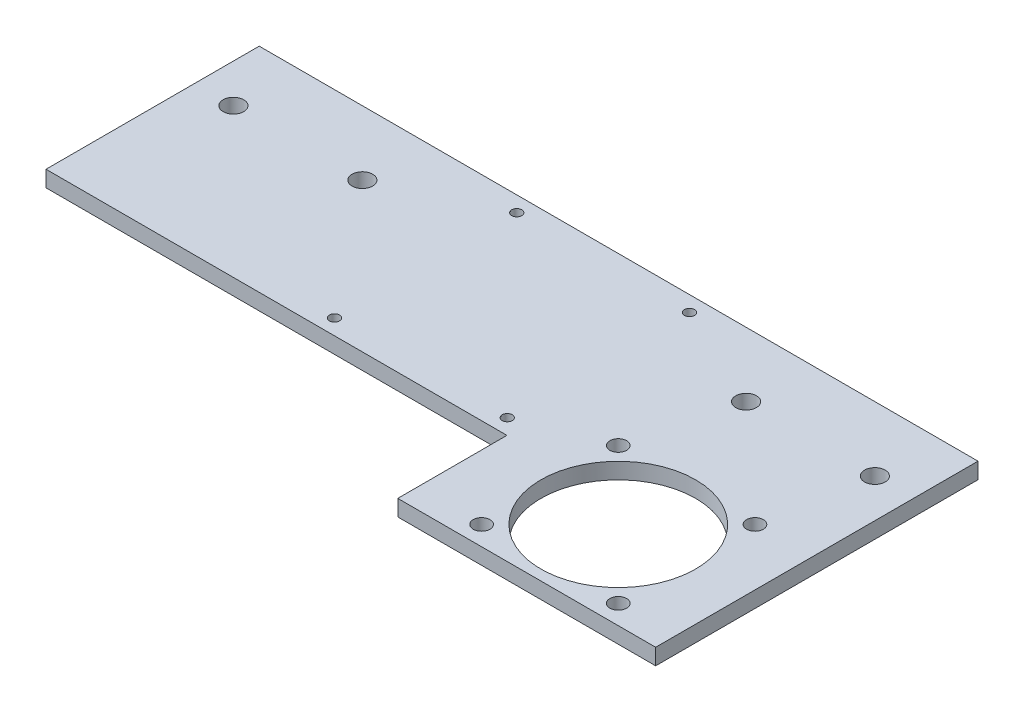
ISO-10303-21;
HEADER;
FILE_DESCRIPTION(('STEP AP214'),'2;1');
FILE_NAME('part.step','',(''),(''),'','','');
FILE_SCHEMA(('AUTOMOTIVE_DESIGN { 1 0 10303 214 1 1 1 1 }'));
ENDSEC;
DATA;
#1=APPLICATION_CONTEXT('core data for automotive mechanical design processes');
#2=APPLICATION_PROTOCOL_DEFINITION('international standard','automotive_design',2000,#1);
#3=PRODUCT_CONTEXT('',#1,'mechanical');
#4=PRODUCT('Part','Part','',(#3));
#5=PRODUCT_RELATED_PRODUCT_CATEGORY('part','',(#4));
#6=PRODUCT_DEFINITION_FORMATION('','',#4);
#7=PRODUCT_DEFINITION_CONTEXT('part definition',#1,'design');
#8=PRODUCT_DEFINITION('design','',#6,#7);
#9=PRODUCT_DEFINITION_SHAPE('','',#8);
#10=(LENGTH_UNIT() NAMED_UNIT(*) SI_UNIT(.MILLI.,.METRE.));
#11=(NAMED_UNIT(*) PLANE_ANGLE_UNIT() SI_UNIT($,.RADIAN.));
#12=(NAMED_UNIT(*) SI_UNIT($,.STERADIAN.) SOLID_ANGLE_UNIT());
#13=UNCERTAINTY_MEASURE_WITH_UNIT(LENGTH_MEASURE(1.E-05),#10,'distance_accuracy_value','');
#14=(GEOMETRIC_REPRESENTATION_CONTEXT(3) GLOBAL_UNCERTAINTY_ASSIGNED_CONTEXT((#13)) GLOBAL_UNIT_ASSIGNED_CONTEXT((#10,
#11,#12)) REPRESENTATION_CONTEXT('',''));
#15=CARTESIAN_POINT('',(0.,0.,0.));
#16=DIRECTION('',(0.,0.,1.));
#17=DIRECTION('',(1.,0.,0.));
#18=AXIS2_PLACEMENT_3D('',#15,#16,#17);
#19=CARTESIAN_POINT('',(20.,3.175,21.));
#20=DIRECTION('',(0.,0.,-1.));
#21=DIRECTION('',(-1.,0.,0.));
#22=AXIS2_PLACEMENT_3D('',#19,#20,#21);
#23=PLANE('',#22);
#24=DIRECTION('',(1.,0.,0.));
#25=VECTOR('',#24,1.);
#26=CARTESIAN_POINT('',(20.,0.,21.));
#27=LINE('',#26,#25);
#28=CARTESIAN_POINT('',(-70.8,0.,21.));
#29=VERTEX_POINT('',#28);
#30=CARTESIAN_POINT('',(20.,0.,21.));
#31=VERTEX_POINT('',#30);
#32=EDGE_CURVE('E91',#29,#31,#27,.T.);
#33=ORIENTED_EDGE('',*,*,#32,.T.);
#34=DIRECTION('',(0.,-1.,0.));
#35=VECTOR('',#34,1.);
#36=CARTESIAN_POINT('',(20.,3.175,21.));
#37=LINE('',#36,#35);
#38=CARTESIAN_POINT('',(20.,3.175,21.));
#39=VERTEX_POINT('',#38);
#40=EDGE_CURVE('E11',#39,#31,#37,.T.);
#41=ORIENTED_EDGE('',*,*,#40,.F.);
#42=DIRECTION('',(1.,0.,0.));
#43=VECTOR('',#42,1.);
#44=CARTESIAN_POINT('',(20.,3.175,21.));
#45=LINE('',#44,#43);
#46=CARTESIAN_POINT('',(-70.8,3.175,21.));
#47=VERTEX_POINT('',#46);
#48=EDGE_CURVE('E53',#47,#39,#45,.T.);
#49=ORIENTED_EDGE('',*,*,#48,.F.);
#50=DIRECTION('',(0.,1.,0.));
#51=VECTOR('',#50,1.);
#52=CARTESIAN_POINT('',(-70.8,0.,21.));
#53=LINE('',#52,#51);
#54=EDGE_CURVE('E101',#29,#47,#53,.T.);
#55=ORIENTED_EDGE('',*,*,#54,.F.);
#56=EDGE_LOOP('',(#33,#41,#49,#55));
#57=FACE_BOUND('',#56,.T.);
#58=ADVANCED_FACE('F39',(#57),#23,.F.);
#59=CARTESIAN_POINT('',(20.,3.175,-21.));
#60=DIRECTION('',(0.,0.,1.));
#61=DIRECTION('',(1.,0.,0.));
#62=AXIS2_PLACEMENT_3D('',#59,#60,#61);
#63=PLANE('',#62);
#64=DIRECTION('',(-1.,0.,0.));
#65=VECTOR('',#64,1.);
#66=CARTESIAN_POINT('',(20.,0.,-21.));
#67=LINE('',#66,#65);
#68=CARTESIAN_POINT('',(70.8,0.,-21.));
#69=VERTEX_POINT('',#68);
#70=CARTESIAN_POINT('',(-70.8,0.,-21.));
#71=VERTEX_POINT('',#70);
#72=EDGE_CURVE('E98',#69,#71,#67,.T.);
#73=ORIENTED_EDGE('',*,*,#72,.T.);
#74=DIRECTION('',(0.,1.,0.));
#75=VECTOR('',#74,1.);
#76=CARTESIAN_POINT('',(-70.8,0.,-21.));
#77=LINE('',#76,#75);
#78=CARTESIAN_POINT('',(-70.8,3.175,-21.));
#79=VERTEX_POINT('',#78);
#80=EDGE_CURVE('E109',#71,#79,#77,.T.);
#81=ORIENTED_EDGE('',*,*,#80,.T.);
#82=DIRECTION('',(-1.,0.,0.));
#83=VECTOR('',#82,1.);
#84=CARTESIAN_POINT('',(20.,3.175,-21.));
#85=LINE('',#84,#83);
#86=CARTESIAN_POINT('',(70.8,3.175,-21.));
#87=VERTEX_POINT('',#86);
#88=EDGE_CURVE('E46',#87,#79,#85,.T.);
#89=ORIENTED_EDGE('',*,*,#88,.F.);
#90=DIRECTION('',(0.,1.,0.));
#91=VECTOR('',#90,1.);
#92=CARTESIAN_POINT('',(70.8,0.,-21.));
#93=LINE('',#92,#91);
#94=EDGE_CURVE('E139',#69,#87,#93,.T.);
#95=ORIENTED_EDGE('',*,*,#94,.F.);
#96=EDGE_LOOP('',(#73,#81,#89,#95));
#97=FACE_BOUND('',#96,.T.);
#98=ADVANCED_FACE('F168',(#97),#63,.F.);
#99=CARTESIAN_POINT('',(0.,3.175,0.));
#100=DIRECTION('',(0.,1.,0.));
#101=DIRECTION('',(0.,0.,1.));
#102=AXIS2_PLACEMENT_3D('',#99,#100,#101);
#103=PLANE('',#102);
#104=DIRECTION('',(0.,0.,1.));
#105=VECTOR('',#104,1.);
#106=CARTESIAN_POINT('',(-70.8,3.175,0.));
#107=LINE('',#106,#105);
#108=EDGE_CURVE('E110',#79,#47,#107,.T.);
#109=ORIENTED_EDGE('',*,*,#108,.T.);
#110=ORIENTED_EDGE('',*,*,#48,.T.);
#111=DIRECTION('',(0.,0.,-1.));
#112=VECTOR('',#111,1.);
#113=CARTESIAN_POINT('',(20.,3.175,0.));
#114=LINE('',#113,#112);
#115=CARTESIAN_POINT('',(20.,3.175,42.5));
#116=VERTEX_POINT('',#115);
#117=EDGE_CURVE('E124',#116,#39,#114,.T.);
#118=ORIENTED_EDGE('',*,*,#117,.F.);
#119=DIRECTION('',(1.,0.,0.));
#120=VECTOR('',#119,1.);
#121=CARTESIAN_POINT('',(0.,3.175,42.5));
#122=LINE('',#121,#120);
#123=CARTESIAN_POINT('',(70.8,3.175,42.5));
#124=VERTEX_POINT('',#123);
#125=EDGE_CURVE('E112',#116,#124,#122,.T.);
#126=ORIENTED_EDGE('',*,*,#125,.T.);
#127=DIRECTION('',(0.,0.,-1.));
#128=VECTOR('',#127,1.);
#129=CARTESIAN_POINT('',(70.8,3.175,0.));
#130=LINE('',#129,#128);
#131=EDGE_CURVE('E131',#124,#87,#130,.T.);
#132=ORIENTED_EDGE('',*,*,#131,.T.);
#133=ORIENTED_EDGE('',*,*,#88,.T.);
#134=EDGE_LOOP('',(#109,#110,#118,#126,#132,#133));
#135=FACE_BOUND('',#134,.T.);
#136=CARTESIAN_POINT('',(46.162,3.175,25.228));
#137=DIRECTION('',(0.,-1.,0.));
#138=DIRECTION('',(0.,0.,-1.));
#139=AXIS2_PLACEMENT_3D('',#136,#137,#138);
#140=CIRCLE('',#139,15.24);
#141=CARTESIAN_POINT('',(46.162,3.175,9.98799999999999));
#142=VERTEX_POINT('',#141);
#143=EDGE_CURVE('E410',#142,#142,#140,.T.);
#144=ORIENTED_EDGE('',*,*,#143,.T.);
#145=EDGE_LOOP('',(#144));
#146=FACE_BOUND('',#145,.T.);
#147=CARTESIAN_POINT('',(32.7,3.175,11.766));
#148=DIRECTION('',(0.,-1.,0.));
#149=DIRECTION('',(0.,0.,-1.));
#150=AXIS2_PLACEMENT_3D('',#147,#148,#149);
#151=CIRCLE('',#150,1.651);
#152=CARTESIAN_POINT('',(32.7,3.175,10.115));
#153=VERTEX_POINT('',#152);
#154=EDGE_CURVE('E423',#153,#153,#151,.T.);
#155=ORIENTED_EDGE('',*,*,#154,.T.);
#156=EDGE_LOOP('',(#155));
#157=FACE_BOUND('',#156,.T.);
#158=CARTESIAN_POINT('',(59.624,3.175,38.69));
#159=DIRECTION('',(0.,-1.,0.));
#160=DIRECTION('',(0.,0.,-1.));
#161=AXIS2_PLACEMENT_3D('',#158,#159,#160);
#162=CIRCLE('',#161,1.651);
#163=CARTESIAN_POINT('',(59.624,3.175,37.039));
#164=VERTEX_POINT('',#163);
#165=EDGE_CURVE('E430',#164,#164,#162,.T.);
#166=ORIENTED_EDGE('',*,*,#165,.T.);
#167=EDGE_LOOP('',(#166));
#168=FACE_BOUND('',#167,.T.);
#169=CARTESIAN_POINT('',(59.624,3.175,11.766));
#170=DIRECTION('',(0.,-1.,0.));
#171=DIRECTION('',(0.,0.,-1.));
#172=AXIS2_PLACEMENT_3D('',#169,#170,#171);
#173=CIRCLE('',#172,1.651);
#174=CARTESIAN_POINT('',(59.624,3.175,10.115));
#175=VERTEX_POINT('',#174);
#176=EDGE_CURVE('E417',#175,#175,#173,.T.);
#177=ORIENTED_EDGE('',*,*,#176,.T.);
#178=EDGE_LOOP('',(#177));
#179=FACE_BOUND('',#178,.T.);
#180=CARTESIAN_POINT('',(32.7,3.175,38.69));
#181=DIRECTION('',(0.,-1.,0.));
#182=DIRECTION('',(0.,0.,-1.));
#183=AXIS2_PLACEMENT_3D('',#180,#181,#182);
#184=CIRCLE('',#183,1.651);
#185=CARTESIAN_POINT('',(32.7,3.175,37.039));
#186=VERTEX_POINT('',#185);
#187=EDGE_CURVE('E435',#186,#186,#184,.T.);
#188=ORIENTED_EDGE('',*,*,#187,.T.);
#189=EDGE_LOOP('',(#188));
#190=FACE_BOUND('',#189,.T.);
#191=CARTESIAN_POINT('',(63.18,3.175,-8.3));
#192=DIRECTION('',(0.,1.,0.));
#193=DIRECTION('',(0.,0.,1.));
#194=AXIS2_PLACEMENT_3D('',#191,#192,#193);
#195=CIRCLE('',#194,2.03200000000001);
#196=CARTESIAN_POINT('',(63.18,3.175,-6.26799999999999));
#197=VERTEX_POINT('',#196);
#198=EDGE_CURVE('E442',#197,#197,#195,.T.);
#199=ORIENTED_EDGE('',*,*,#198,.F.);
#200=EDGE_LOOP('',(#199));
#201=FACE_BOUND('',#200,.T.);
#202=CARTESIAN_POINT('',(37.8145438672977,3.175,-8.3));
#203=DIRECTION('',(0.,1.,0.));
#204=DIRECTION('',(0.,0.,1.));
#205=AXIS2_PLACEMENT_3D('',#202,#203,#204);
#206=CIRCLE('',#205,2.032);
#207=CARTESIAN_POINT('',(37.8145438672977,3.175,-6.268));
#208=VERTEX_POINT('',#207);
#209=EDGE_CURVE('E448',#208,#208,#206,.T.);
#210=ORIENTED_EDGE('',*,*,#209,.F.);
#211=EDGE_LOOP('',(#210));
#212=FACE_BOUND('',#211,.T.);
#213=CARTESIAN_POINT('',(-37.78,3.175,-8.3));
#214=DIRECTION('',(0.,1.,0.));
#215=DIRECTION('',(0.,0.,1.));
#216=AXIS2_PLACEMENT_3D('',#213,#214,#215);
#217=CIRCLE('',#216,2.032);
#218=CARTESIAN_POINT('',(-37.78,3.175,-6.268));
#219=VERTEX_POINT('',#218);
#220=EDGE_CURVE('E454',#219,#219,#217,.T.);
#221=ORIENTED_EDGE('',*,*,#220,.F.);
#222=EDGE_LOOP('',(#221));
#223=FACE_BOUND('',#222,.T.);
#224=CARTESIAN_POINT('',(-63.18,3.175,-8.3));
#225=DIRECTION('',(0.,1.,0.));
#226=DIRECTION('',(0.,0.,1.));
#227=AXIS2_PLACEMENT_3D('',#224,#225,#226);
#228=CIRCLE('',#227,2.032);
#229=CARTESIAN_POINT('',(-63.18,3.175,-6.268));
#230=VERTEX_POINT('',#229);
#231=EDGE_CURVE('E117',#230,#230,#228,.T.);
#232=ORIENTED_EDGE('',*,*,#231,.F.);
#233=EDGE_LOOP('',(#232));
#234=FACE_BOUND('',#233,.T.);
#235=CARTESIAN_POINT('',(-17.015999872,3.175,17.952));
#236=DIRECTION('',(0.,1.,0.));
#237=DIRECTION('',(0.,0.,-1.));
#238=AXIS2_PLACEMENT_3D('',#235,#236,#237);
#239=CIRCLE('',#238,1.);
#240=CARTESIAN_POINT('',(-17.015999872,3.175,16.952));
#241=VERTEX_POINT('',#240);
#242=EDGE_CURVE('E153',#241,#241,#239,.T.);
#243=ORIENTED_EDGE('',*,*,#242,.F.);
#244=EDGE_LOOP('',(#243));
#245=FACE_BOUND('',#244,.T.);
#246=CARTESIAN_POINT('',(17.015999872,3.175,-17.952));
#247=DIRECTION('',(0.,1.,0.));
#248=DIRECTION('',(0.,0.,-1.));
#249=AXIS2_PLACEMENT_3D('',#246,#247,#248);
#250=CIRCLE('',#249,1.);
#251=CARTESIAN_POINT('',(17.015999872,3.175,-18.952));
#252=VERTEX_POINT('',#251);
#253=EDGE_CURVE('E146',#252,#252,#250,.T.);
#254=ORIENTED_EDGE('',*,*,#253,.F.);
#255=EDGE_LOOP('',(#254));
#256=FACE_BOUND('',#255,.T.);
#257=CARTESIAN_POINT('',(-17.015999872,3.175,-17.952));
#258=DIRECTION('',(0.,1.,0.));
#259=DIRECTION('',(0.,0.,1.));
#260=AXIS2_PLACEMENT_3D('',#257,#258,#259);
#261=CIRCLE('',#260,1.);
#262=CARTESIAN_POINT('',(-17.015999872,3.175,-16.952));
#263=VERTEX_POINT('',#262);
#264=EDGE_CURVE('E138',#263,#263,#261,.T.);
#265=ORIENTED_EDGE('',*,*,#264,.F.);
#266=EDGE_LOOP('',(#265));
#267=FACE_BOUND('',#266,.T.);
#268=CARTESIAN_POINT('',(17.015999872,3.175,17.952));
#269=DIRECTION('',(0.,1.,0.));
#270=DIRECTION('',(0.,0.,1.));
#271=AXIS2_PLACEMENT_3D('',#268,#269,#270);
#272=CIRCLE('',#271,1.);
#273=CARTESIAN_POINT('',(17.015999872,3.175,18.952));
#274=VERTEX_POINT('',#273);
#275=EDGE_CURVE('E152',#274,#274,#272,.T.);
#276=ORIENTED_EDGE('',*,*,#275,.F.);
#277=EDGE_LOOP('',(#276));
#278=FACE_BOUND('',#277,.T.);
#279=ADVANCED_FACE('F177',(#135,#146,#157,#168,#179,#190,#201,#212,#223,#234,#245,#256,#267,
#278),#103,.T.);
#280=CARTESIAN_POINT('',(0.,0.,0.));
#281=DIRECTION('',(0.,1.,0.));
#282=DIRECTION('',(0.,0.,1.));
#283=AXIS2_PLACEMENT_3D('',#280,#281,#282);
#284=PLANE('',#283);
#285=CARTESIAN_POINT('',(46.162,0.,25.228));
#286=DIRECTION('',(0.,-1.,0.));
#287=DIRECTION('',(0.,0.,-1.));
#288=AXIS2_PLACEMENT_3D('',#285,#286,#287);
#289=CIRCLE('',#288,15.24);
#290=CARTESIAN_POINT('',(46.162,0.,9.98799999999999));
#291=VERTEX_POINT('',#290);
#292=EDGE_CURVE('E104',#291,#291,#289,.T.);
#293=ORIENTED_EDGE('',*,*,#292,.F.);
#294=EDGE_LOOP('',(#293));
#295=FACE_BOUND('',#294,.T.);
#296=CARTESIAN_POINT('',(32.7,0.,11.766));
#297=DIRECTION('',(0.,-1.,0.));
#298=DIRECTION('',(0.,0.,-1.));
#299=AXIS2_PLACEMENT_3D('',#296,#297,#298);
#300=CIRCLE('',#299,1.651);
#301=CARTESIAN_POINT('',(32.7,0.,10.115));
#302=VERTEX_POINT('',#301);
#303=EDGE_CURVE('E427',#302,#302,#300,.T.);
#304=ORIENTED_EDGE('',*,*,#303,.F.);
#305=EDGE_LOOP('',(#304));
#306=FACE_BOUND('',#305,.T.);
#307=CARTESIAN_POINT('',(59.624,0.,38.69));
#308=DIRECTION('',(0.,-1.,0.));
#309=DIRECTION('',(0.,0.,-1.));
#310=AXIS2_PLACEMENT_3D('',#307,#308,#309);
#311=CIRCLE('',#310,1.651);
#312=CARTESIAN_POINT('',(59.624,0.,37.039));
#313=VERTEX_POINT('',#312);
#314=EDGE_CURVE('E420',#313,#313,#311,.T.);
#315=ORIENTED_EDGE('',*,*,#314,.F.);
#316=EDGE_LOOP('',(#315));
#317=FACE_BOUND('',#316,.T.);
#318=CARTESIAN_POINT('',(59.624,0.,11.766));
#319=DIRECTION('',(0.,-1.,0.));
#320=DIRECTION('',(0.,0.,-1.));
#321=AXIS2_PLACEMENT_3D('',#318,#319,#320);
#322=CIRCLE('',#321,1.651);
#323=CARTESIAN_POINT('',(59.624,0.,10.115));
#324=VERTEX_POINT('',#323);
#325=EDGE_CURVE('E414',#324,#324,#322,.T.);
#326=ORIENTED_EDGE('',*,*,#325,.F.);
#327=EDGE_LOOP('',(#326));
#328=FACE_BOUND('',#327,.T.);
#329=CARTESIAN_POINT('',(32.7,0.,38.69));
#330=DIRECTION('',(0.,-1.,0.));
#331=DIRECTION('',(0.,0.,-1.));
#332=AXIS2_PLACEMENT_3D('',#329,#330,#331);
#333=CIRCLE('',#332,1.651);
#334=CARTESIAN_POINT('',(32.7,0.,37.039));
#335=VERTEX_POINT('',#334);
#336=EDGE_CURVE('E426',#335,#335,#333,.T.);
#337=ORIENTED_EDGE('',*,*,#336,.F.);
#338=EDGE_LOOP('',(#337));
#339=FACE_BOUND('',#338,.T.);
#340=CARTESIAN_POINT('',(63.18,0.,-8.3));
#341=DIRECTION('',(0.,1.,0.));
#342=DIRECTION('',(0.,0.,1.));
#343=AXIS2_PLACEMENT_3D('',#340,#341,#342);
#344=CIRCLE('',#343,2.03200000000001);
#345=CARTESIAN_POINT('',(63.18,0.,-6.26799999999999));
#346=VERTEX_POINT('',#345);
#347=EDGE_CURVE('E114',#346,#346,#344,.T.);
#348=ORIENTED_EDGE('',*,*,#347,.T.);
#349=EDGE_LOOP('',(#348));
#350=FACE_BOUND('',#349,.T.);
#351=CARTESIAN_POINT('',(37.8145438672977,0.,-8.3));
#352=DIRECTION('',(0.,1.,0.));
#353=DIRECTION('',(0.,0.,1.));
#354=AXIS2_PLACEMENT_3D('',#351,#352,#353);
#355=CIRCLE('',#354,2.032);
#356=CARTESIAN_POINT('',(37.8145438672977,0.,-6.268));
#357=VERTEX_POINT('',#356);
#358=EDGE_CURVE('E445',#357,#357,#355,.T.);
#359=ORIENTED_EDGE('',*,*,#358,.T.);
#360=EDGE_LOOP('',(#359));
#361=FACE_BOUND('',#360,.T.);
#362=CARTESIAN_POINT('',(-37.78,0.,-8.3));
#363=DIRECTION('',(0.,1.,0.));
#364=DIRECTION('',(0.,0.,1.));
#365=AXIS2_PLACEMENT_3D('',#362,#363,#364);
#366=CIRCLE('',#365,2.032);
#367=CARTESIAN_POINT('',(-37.78,0.,-6.268));
#368=VERTEX_POINT('',#367);
#369=EDGE_CURVE('E451',#368,#368,#366,.T.);
#370=ORIENTED_EDGE('',*,*,#369,.T.);
#371=EDGE_LOOP('',(#370));
#372=FACE_BOUND('',#371,.T.);
#373=CARTESIAN_POINT('',(-63.18,0.,-8.3));
#374=DIRECTION('',(0.,1.,0.));
#375=DIRECTION('',(0.,0.,1.));
#376=AXIS2_PLACEMENT_3D('',#373,#374,#375);
#377=CIRCLE('',#376,2.032);
#378=CARTESIAN_POINT('',(-63.18,0.,-6.268));
#379=VERTEX_POINT('',#378);
#380=EDGE_CURVE('E456',#379,#379,#377,.T.);
#381=ORIENTED_EDGE('',*,*,#380,.T.);
#382=EDGE_LOOP('',(#381));
#383=FACE_BOUND('',#382,.T.);
#384=CARTESIAN_POINT('',(-17.015999872,0.,17.952));
#385=DIRECTION('',(0.,1.,0.));
#386=DIRECTION('',(0.,0.,-1.));
#387=AXIS2_PLACEMENT_3D('',#384,#385,#386);
#388=CIRCLE('',#387,1.);
#389=CARTESIAN_POINT('',(-17.015999872,0.,16.952));
#390=VERTEX_POINT('',#389);
#391=EDGE_CURVE('E149',#390,#390,#388,.T.);
#392=ORIENTED_EDGE('',*,*,#391,.T.);
#393=EDGE_LOOP('',(#392));
#394=FACE_BOUND('',#393,.T.);
#395=CARTESIAN_POINT('',(17.015999872,0.,-17.952));
#396=DIRECTION('',(0.,1.,0.));
#397=DIRECTION('',(0.,0.,-1.));
#398=AXIS2_PLACEMENT_3D('',#395,#396,#397);
#399=CIRCLE('',#398,1.);
#400=CARTESIAN_POINT('',(17.015999872,0.,-18.952));
#401=VERTEX_POINT('',#400);
#402=EDGE_CURVE('E156',#401,#401,#399,.T.);
#403=ORIENTED_EDGE('',*,*,#402,.T.);
#404=EDGE_LOOP('',(#403));
#405=FACE_BOUND('',#404,.T.);
#406=CARTESIAN_POINT('',(-17.015999872,0.,-17.952));
#407=DIRECTION('',(0.,1.,0.));
#408=DIRECTION('',(0.,0.,1.));
#409=AXIS2_PLACEMENT_3D('',#406,#407,#408);
#410=CIRCLE('',#409,1.);
#411=CARTESIAN_POINT('',(-17.015999872,0.,-16.952));
#412=VERTEX_POINT('',#411);
#413=EDGE_CURVE('E143',#412,#412,#410,.T.);
#414=ORIENTED_EDGE('',*,*,#413,.T.);
#415=EDGE_LOOP('',(#414));
#416=FACE_BOUND('',#415,.T.);
#417=CARTESIAN_POINT('',(17.015999872,0.,17.952));
#418=DIRECTION('',(0.,1.,0.));
#419=DIRECTION('',(0.,0.,1.));
#420=AXIS2_PLACEMENT_3D('',#417,#418,#419);
#421=CIRCLE('',#420,1.);
#422=CARTESIAN_POINT('',(17.015999872,0.,18.952));
#423=VERTEX_POINT('',#422);
#424=EDGE_CURVE('E99',#423,#423,#421,.T.);
#425=ORIENTED_EDGE('',*,*,#424,.T.);
#426=EDGE_LOOP('',(#425));
#427=FACE_BOUND('',#426,.T.);
#428=ORIENTED_EDGE('',*,*,#32,.F.);
#429=DIRECTION('',(0.,0.,1.));
#430=VECTOR('',#429,1.);
#431=CARTESIAN_POINT('',(-70.8,0.,0.));
#432=LINE('',#431,#430);
#433=EDGE_CURVE('E94',#71,#29,#432,.T.);
#434=ORIENTED_EDGE('',*,*,#433,.F.);
#435=ORIENTED_EDGE('',*,*,#72,.F.);
#436=DIRECTION('',(0.,0.,-1.));
#437=VECTOR('',#436,1.);
#438=CARTESIAN_POINT('',(70.8,0.,0.));
#439=LINE('',#438,#437);
#440=CARTESIAN_POINT('',(70.8,0.,42.5));
#441=VERTEX_POINT('',#440);
#442=EDGE_CURVE('E123',#441,#69,#439,.T.);
#443=ORIENTED_EDGE('',*,*,#442,.F.);
#444=DIRECTION('',(1.,0.,0.));
#445=VECTOR('',#444,1.);
#446=CARTESIAN_POINT('',(0.,0.,42.5));
#447=LINE('',#446,#445);
#448=CARTESIAN_POINT('',(20.,0.,42.5));
#449=VERTEX_POINT('',#448);
#450=EDGE_CURVE('E120',#449,#441,#447,.T.);
#451=ORIENTED_EDGE('',*,*,#450,.F.);
#452=DIRECTION('',(0.,0.,-1.));
#453=VECTOR('',#452,1.);
#454=CARTESIAN_POINT('',(20.,0.,0.));
#455=LINE('',#454,#453);
#456=EDGE_CURVE('E97',#449,#31,#455,.T.);
#457=ORIENTED_EDGE('',*,*,#456,.T.);
#458=EDGE_LOOP('',(#428,#434,#435,#443,#451,#457));
#459=FACE_BOUND('',#458,.T.);
#460=ADVANCED_FACE('F92',(#295,#306,#317,#328,#339,#350,#361,#372,#383,#394,#405,#416,#427,
#459),#284,.F.);
#461=CARTESIAN_POINT('',(17.015999872,0.,17.952));
#462=DIRECTION('',(0.,1.,0.));
#463=DIRECTION('',(0.,0.,1.));
#464=AXIS2_PLACEMENT_3D('',#461,#462,#463);
#465=CYLINDRICAL_SURFACE('',#464,1.);
#466=ORIENTED_EDGE('',*,*,#424,.F.);
#467=EDGE_LOOP('',(#466));
#468=FACE_BOUND('',#467,.T.);
#469=ORIENTED_EDGE('',*,*,#275,.T.);
#470=EDGE_LOOP('',(#469));
#471=FACE_BOUND('',#470,.T.);
#472=ADVANCED_FACE('F200',(#468,#471),#465,.F.);
#473=CARTESIAN_POINT('',(-17.015999872,0.,-17.952));
#474=DIRECTION('',(0.,1.,0.));
#475=DIRECTION('',(0.,0.,1.));
#476=AXIS2_PLACEMENT_3D('',#473,#474,#475);
#477=CYLINDRICAL_SURFACE('',#476,1.);
#478=ORIENTED_EDGE('',*,*,#413,.F.);
#479=EDGE_LOOP('',(#478));
#480=FACE_BOUND('',#479,.T.);
#481=ORIENTED_EDGE('',*,*,#264,.T.);
#482=EDGE_LOOP('',(#481));
#483=FACE_BOUND('',#482,.T.);
#484=ADVANCED_FACE('F205',(#480,#483),#477,.F.);
#485=CARTESIAN_POINT('',(17.015999872,0.,-17.952));
#486=DIRECTION('',(0.,1.,0.));
#487=DIRECTION('',(0.,0.,1.));
#488=AXIS2_PLACEMENT_3D('',#485,#486,#487);
#489=CYLINDRICAL_SURFACE('',#488,1.);
#490=ORIENTED_EDGE('',*,*,#402,.F.);
#491=EDGE_LOOP('',(#490));
#492=FACE_BOUND('',#491,.T.);
#493=ORIENTED_EDGE('',*,*,#253,.T.);
#494=EDGE_LOOP('',(#493));
#495=FACE_BOUND('',#494,.T.);
#496=ADVANCED_FACE('F207',(#492,#495),#489,.F.);
#497=CARTESIAN_POINT('',(-17.015999872,0.,17.952));
#498=DIRECTION('',(0.,1.,0.));
#499=DIRECTION('',(0.,0.,1.));
#500=AXIS2_PLACEMENT_3D('',#497,#498,#499);
#501=CYLINDRICAL_SURFACE('',#500,1.);
#502=ORIENTED_EDGE('',*,*,#391,.F.);
#503=EDGE_LOOP('',(#502));
#504=FACE_BOUND('',#503,.T.);
#505=ORIENTED_EDGE('',*,*,#242,.T.);
#506=EDGE_LOOP('',(#505));
#507=FACE_BOUND('',#506,.T.);
#508=ADVANCED_FACE('F210',(#504,#507),#501,.F.);
#509=CARTESIAN_POINT('',(20.,0.,0.));
#510=DIRECTION('',(1.,0.,0.));
#511=DIRECTION('',(0.,0.,-1.));
#512=AXIS2_PLACEMENT_3D('',#509,#510,#511);
#513=PLANE('',#512);
#514=ORIENTED_EDGE('',*,*,#117,.T.);
#515=ORIENTED_EDGE('',*,*,#40,.T.);
#516=ORIENTED_EDGE('',*,*,#456,.F.);
#517=DIRECTION('',(0.,1.,0.));
#518=VECTOR('',#517,1.);
#519=CARTESIAN_POINT('',(20.,0.,42.5));
#520=LINE('',#519,#518);
#521=EDGE_CURVE('E136',#449,#116,#520,.T.);
#522=ORIENTED_EDGE('',*,*,#521,.T.);
#523=EDGE_LOOP('',(#514,#515,#516,#522));
#524=FACE_BOUND('',#523,.T.);
#525=ADVANCED_FACE('F176',(#524),#513,.F.);
#526=CARTESIAN_POINT('',(0.,0.,42.5));
#527=DIRECTION('',(0.,0.,1.));
#528=DIRECTION('',(1.,0.,0.));
#529=AXIS2_PLACEMENT_3D('',#526,#527,#528);
#530=PLANE('',#529);
#531=ORIENTED_EDGE('',*,*,#125,.F.);
#532=ORIENTED_EDGE('',*,*,#521,.F.);
#533=ORIENTED_EDGE('',*,*,#450,.T.);
#534=DIRECTION('',(0.,1.,0.));
#535=VECTOR('',#534,1.);
#536=CARTESIAN_POINT('',(70.8,0.,42.5));
#537=LINE('',#536,#535);
#538=EDGE_CURVE('E128',#441,#124,#537,.T.);
#539=ORIENTED_EDGE('',*,*,#538,.T.);
#540=EDGE_LOOP('',(#531,#532,#533,#539));
#541=FACE_BOUND('',#540,.T.);
#542=ADVANCED_FACE('F173',(#541),#530,.T.);
#543=CARTESIAN_POINT('',(70.8,0.,0.));
#544=DIRECTION('',(1.,0.,0.));
#545=DIRECTION('',(0.,0.,-1.));
#546=AXIS2_PLACEMENT_3D('',#543,#544,#545);
#547=PLANE('',#546);
#548=ORIENTED_EDGE('',*,*,#131,.F.);
#549=ORIENTED_EDGE('',*,*,#538,.F.);
#550=ORIENTED_EDGE('',*,*,#442,.T.);
#551=ORIENTED_EDGE('',*,*,#94,.T.);
#552=EDGE_LOOP('',(#548,#549,#550,#551));
#553=FACE_BOUND('',#552,.T.);
#554=ADVANCED_FACE('F179',(#553),#547,.T.);
#555=CARTESIAN_POINT('',(-70.8,0.,0.));
#556=DIRECTION('',(-1.,0.,0.));
#557=DIRECTION('',(0.,0.,1.));
#558=AXIS2_PLACEMENT_3D('',#555,#556,#557);
#559=PLANE('',#558);
#560=ORIENTED_EDGE('',*,*,#54,.T.);
#561=ORIENTED_EDGE('',*,*,#108,.F.);
#562=ORIENTED_EDGE('',*,*,#80,.F.);
#563=ORIENTED_EDGE('',*,*,#433,.T.);
#564=EDGE_LOOP('',(#560,#561,#562,#563));
#565=FACE_BOUND('',#564,.T.);
#566=ADVANCED_FACE('F107',(#565),#559,.T.);
#567=CARTESIAN_POINT('',(-63.18,0.,-8.3));
#568=DIRECTION('',(0.,1.,0.));
#569=DIRECTION('',(0.,0.,1.));
#570=AXIS2_PLACEMENT_3D('',#567,#568,#569);
#571=CYLINDRICAL_SURFACE('',#570,2.032);
#572=ORIENTED_EDGE('',*,*,#380,.F.);
#573=EDGE_LOOP('',(#572));
#574=FACE_BOUND('',#573,.T.);
#575=ORIENTED_EDGE('',*,*,#231,.T.);
#576=EDGE_LOOP('',(#575));
#577=FACE_BOUND('',#576,.T.);
#578=ADVANCED_FACE('F186',(#574,#577),#571,.F.);
#579=CARTESIAN_POINT('',(-37.78,0.,-8.3));
#580=DIRECTION('',(0.,1.,0.));
#581=DIRECTION('',(0.,0.,1.));
#582=AXIS2_PLACEMENT_3D('',#579,#580,#581);
#583=CYLINDRICAL_SURFACE('',#582,2.032);
#584=ORIENTED_EDGE('',*,*,#369,.F.);
#585=EDGE_LOOP('',(#584));
#586=FACE_BOUND('',#585,.T.);
#587=ORIENTED_EDGE('',*,*,#220,.T.);
#588=EDGE_LOOP('',(#587));
#589=FACE_BOUND('',#588,.T.);
#590=ADVANCED_FACE('F262',(#586,#589),#583,.F.);
#591=CARTESIAN_POINT('',(37.8145438672977,0.,-8.3));
#592=DIRECTION('',(0.,1.,0.));
#593=DIRECTION('',(0.,0.,1.));
#594=AXIS2_PLACEMENT_3D('',#591,#592,#593);
#595=CYLINDRICAL_SURFACE('',#594,2.032);
#596=ORIENTED_EDGE('',*,*,#358,.F.);
#597=EDGE_LOOP('',(#596));
#598=FACE_BOUND('',#597,.T.);
#599=ORIENTED_EDGE('',*,*,#209,.T.);
#600=EDGE_LOOP('',(#599));
#601=FACE_BOUND('',#600,.T.);
#602=ADVANCED_FACE('F272',(#598,#601),#595,.F.);
#603=CARTESIAN_POINT('',(63.18,0.,-8.3));
#604=DIRECTION('',(0.,1.,0.));
#605=DIRECTION('',(0.,0.,1.));
#606=AXIS2_PLACEMENT_3D('',#603,#604,#605);
#607=CYLINDRICAL_SURFACE('',#606,2.03200000000001);
#608=ORIENTED_EDGE('',*,*,#347,.F.);
#609=EDGE_LOOP('',(#608));
#610=FACE_BOUND('',#609,.T.);
#611=ORIENTED_EDGE('',*,*,#198,.T.);
#612=EDGE_LOOP('',(#611));
#613=FACE_BOUND('',#612,.T.);
#614=ADVANCED_FACE('F282',(#610,#613),#607,.F.);
#615=CARTESIAN_POINT('',(32.7,3.175,38.69));
#616=DIRECTION('',(0.,-1.,0.));
#617=DIRECTION('',(0.,0.,-1.));
#618=AXIS2_PLACEMENT_3D('',#615,#616,#617);
#619=CYLINDRICAL_SURFACE('',#618,1.651);
#620=ORIENTED_EDGE('',*,*,#187,.F.);
#621=EDGE_LOOP('',(#620));
#622=FACE_BOUND('',#621,.T.);
#623=ORIENTED_EDGE('',*,*,#336,.T.);
#624=EDGE_LOOP('',(#623));
#625=FACE_BOUND('',#624,.T.);
#626=ADVANCED_FACE('F292',(#622,#625),#619,.F.);
#627=CARTESIAN_POINT('',(59.624,3.175,11.766));
#628=DIRECTION('',(0.,-1.,0.));
#629=DIRECTION('',(0.,0.,-1.));
#630=AXIS2_PLACEMENT_3D('',#627,#628,#629);
#631=CYLINDRICAL_SURFACE('',#630,1.651);
#632=ORIENTED_EDGE('',*,*,#176,.F.);
#633=EDGE_LOOP('',(#632));
#634=FACE_BOUND('',#633,.T.);
#635=ORIENTED_EDGE('',*,*,#325,.T.);
#636=EDGE_LOOP('',(#635));
#637=FACE_BOUND('',#636,.T.);
#638=ADVANCED_FACE('F302',(#634,#637),#631,.F.);
#639=CARTESIAN_POINT('',(59.624,3.175,38.69));
#640=DIRECTION('',(0.,-1.,0.));
#641=DIRECTION('',(0.,0.,-1.));
#642=AXIS2_PLACEMENT_3D('',#639,#640,#641);
#643=CYLINDRICAL_SURFACE('',#642,1.651);
#644=ORIENTED_EDGE('',*,*,#165,.F.);
#645=EDGE_LOOP('',(#644));
#646=FACE_BOUND('',#645,.T.);
#647=ORIENTED_EDGE('',*,*,#314,.T.);
#648=EDGE_LOOP('',(#647));
#649=FACE_BOUND('',#648,.T.);
#650=ADVANCED_FACE('F312',(#646,#649),#643,.F.);
#651=CARTESIAN_POINT('',(32.7,3.175,11.766));
#652=DIRECTION('',(0.,-1.,0.));
#653=DIRECTION('',(0.,0.,-1.));
#654=AXIS2_PLACEMENT_3D('',#651,#652,#653);
#655=CYLINDRICAL_SURFACE('',#654,1.651);
#656=ORIENTED_EDGE('',*,*,#154,.F.);
#657=EDGE_LOOP('',(#656));
#658=FACE_BOUND('',#657,.T.);
#659=ORIENTED_EDGE('',*,*,#303,.T.);
#660=EDGE_LOOP('',(#659));
#661=FACE_BOUND('',#660,.T.);
#662=ADVANCED_FACE('F322',(#658,#661),#655,.F.);
#663=CARTESIAN_POINT('',(46.162,3.175,25.228));
#664=DIRECTION('',(0.,-1.,0.));
#665=DIRECTION('',(0.,0.,-1.));
#666=AXIS2_PLACEMENT_3D('',#663,#664,#665);
#667=CYLINDRICAL_SURFACE('',#666,15.24);
#668=ORIENTED_EDGE('',*,*,#143,.F.);
#669=EDGE_LOOP('',(#668));
#670=FACE_BOUND('',#669,.T.);
#671=ORIENTED_EDGE('',*,*,#292,.T.);
#672=EDGE_LOOP('',(#671));
#673=FACE_BOUND('',#672,.T.);
#674=ADVANCED_FACE('F332',(#670,#673),#667,.F.);
#675=CLOSED_SHELL('',(#58,#98,#279,#460,#472,#484,#496,#508,#525,#542,#554,#566,#578,#590,#602,
#614,#626,#638,#650,#662,#674));
#676=MANIFOLD_SOLID_BREP('B2',#675);
#677=ADVANCED_BREP_SHAPE_REPRESENTATION('',(#18,#676),#14);
#678=SHAPE_DEFINITION_REPRESENTATION(#9,#677);
ENDSEC;
END-ISO-10303-21;
